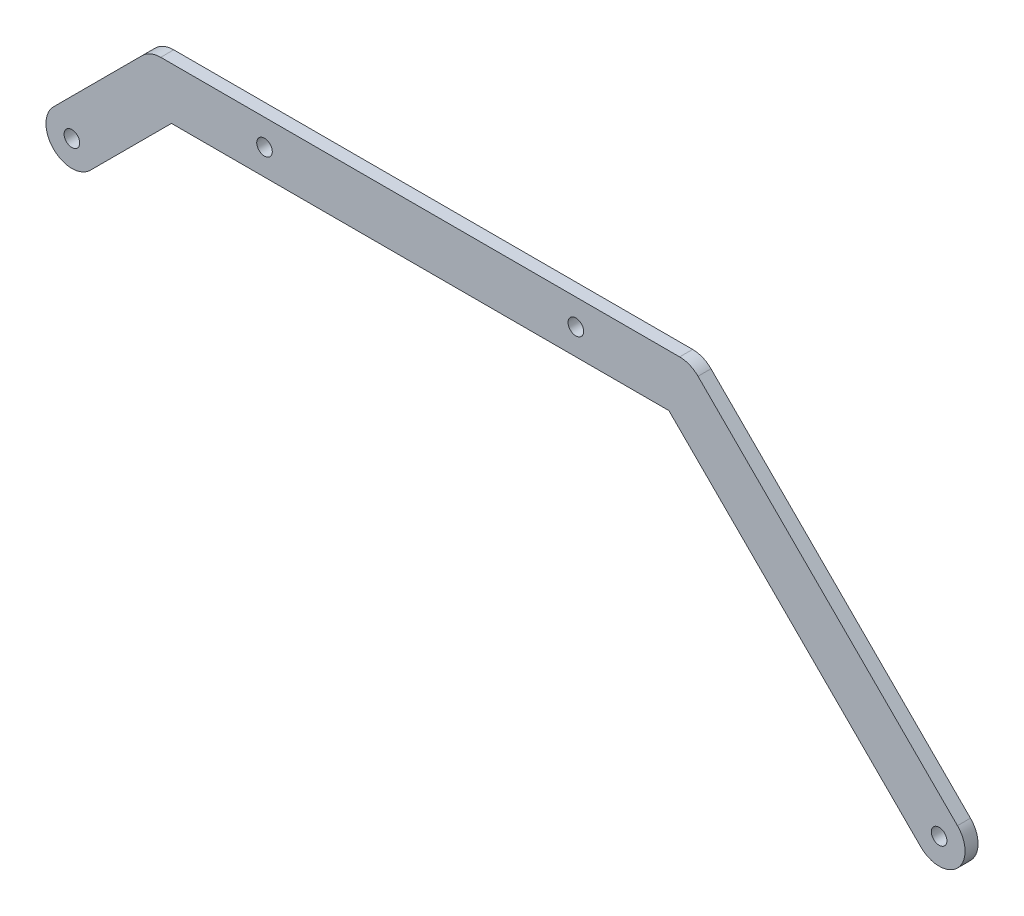
ISO-10303-21;
HEADER;
FILE_DESCRIPTION(('STEP AP214'),'2;1');
FILE_NAME('part.step','',(''),(''),'','','');
FILE_SCHEMA(('AUTOMOTIVE_DESIGN { 1 0 10303 214 1 1 1 1 }'));
ENDSEC;
DATA;
#1=APPLICATION_CONTEXT('core data for automotive mechanical design processes');
#2=APPLICATION_PROTOCOL_DEFINITION('international standard','automotive_design',2000,#1);
#3=PRODUCT_CONTEXT('',#1,'mechanical');
#4=PRODUCT('Part','Part','',(#3));
#5=PRODUCT_RELATED_PRODUCT_CATEGORY('part','',(#4));
#6=PRODUCT_DEFINITION_FORMATION('','',#4);
#7=PRODUCT_DEFINITION_CONTEXT('part definition',#1,'design');
#8=PRODUCT_DEFINITION('design','',#6,#7);
#9=PRODUCT_DEFINITION_SHAPE('','',#8);
#10=(LENGTH_UNIT() NAMED_UNIT(*) SI_UNIT(.MILLI.,.METRE.));
#11=(NAMED_UNIT(*) PLANE_ANGLE_UNIT() SI_UNIT($,.RADIAN.));
#12=(NAMED_UNIT(*) SI_UNIT($,.STERADIAN.) SOLID_ANGLE_UNIT());
#13=UNCERTAINTY_MEASURE_WITH_UNIT(LENGTH_MEASURE(1.E-05),#10,'distance_accuracy_value','');
#14=(GEOMETRIC_REPRESENTATION_CONTEXT(3) GLOBAL_UNCERTAINTY_ASSIGNED_CONTEXT((#13)) GLOBAL_UNIT_ASSIGNED_CONTEXT((#10,
#11,#12)) REPRESENTATION_CONTEXT('',''));
#15=CARTESIAN_POINT('',(0.,0.,0.));
#16=DIRECTION('',(0.,0.,1.));
#17=DIRECTION('',(1.,0.,0.));
#18=AXIS2_PLACEMENT_3D('',#15,#16,#17);
#19=CARTESIAN_POINT('',(0.,-10.0000000000005,5.));
#20=DIRECTION('',(0.,1.,0.));
#21=DIRECTION('',(-1.,0.,0.));
#22=AXIS2_PLACEMENT_3D('',#19,#20,#21);
#23=PLANE('',#22);
#24=DIRECTION('',(1.,0.,0.));
#25=VECTOR('',#24,1.);
#26=CARTESIAN_POINT('',(0.,-10.0000000000005,0.));
#27=LINE('',#26,#25);
#28=CARTESIAN_POINT('',(-195.857864376269,-10.0000000000001,0.));
#29=VERTEX_POINT('',#28);
#30=CARTESIAN_POINT('',(-4.14213562373144,-10.0000000000005,0.));
#31=VERTEX_POINT('',#30);
#32=EDGE_CURVE('E157',#29,#31,#27,.T.);
#33=ORIENTED_EDGE('',*,*,#32,.T.);
#34=DIRECTION('',(0.,0.,-1.));
#35=VECTOR('',#34,1.);
#36=CARTESIAN_POINT('',(-4.14213562373144,-10.0000000000005,5.));
#37=LINE('',#36,#35);
#38=CARTESIAN_POINT('',(-4.14213562373144,-10.0000000000005,5.));
#39=VERTEX_POINT('',#38);
#40=EDGE_CURVE('E11',#39,#31,#37,.T.);
#41=ORIENTED_EDGE('',*,*,#40,.F.);
#42=DIRECTION('',(1.,0.,0.));
#43=VECTOR('',#42,1.);
#44=CARTESIAN_POINT('',(0.,-10.0000000000005,5.));
#45=LINE('',#44,#43);
#46=CARTESIAN_POINT('',(-195.857864376269,-10.0000000000001,5.));
#47=VERTEX_POINT('',#46);
#48=EDGE_CURVE('E193',#47,#39,#45,.T.);
#49=ORIENTED_EDGE('',*,*,#48,.F.);
#50=DIRECTION('',(0.,0.,-1.));
#51=VECTOR('',#50,1.);
#52=CARTESIAN_POINT('',(-195.857864376269,-10.0000000000001,5.));
#53=LINE('',#52,#51);
#54=EDGE_CURVE('E50',#47,#29,#53,.T.);
#55=ORIENTED_EDGE('',*,*,#54,.T.);
#56=EDGE_LOOP('',(#33,#41,#49,#55));
#57=FACE_BOUND('',#56,.T.);
#58=ADVANCED_FACE('F34',(#57),#23,.F.);
#59=CARTESIAN_POINT('',(-7.07106781186593,-7.07106781186603,5.));
#60=DIRECTION('',(0.707106781186543,0.707106781186552,0.));
#61=DIRECTION('',(-0.707106781186552,0.707106781186543,0.));
#62=AXIS2_PLACEMENT_3D('',#59,#60,#61);
#63=PLANE('',#62);
#64=DIRECTION('',(0.707106781186552,-0.707106781186543,0.));
#65=VECTOR('',#64,1.);
#66=CARTESIAN_POINT('',(-7.07106781186593,-7.07106781186603,0.));
#67=LINE('',#66,#65);
#68=CARTESIAN_POINT('',(92.928932188135,-107.071067811866,0.));
#69=VERTEX_POINT('',#68);
#70=EDGE_CURVE('E159',#31,#69,#67,.T.);
#71=ORIENTED_EDGE('',*,*,#70,.T.);
#72=DIRECTION('',(0.,0.,-1.));
#73=VECTOR('',#72,1.);
#74=CARTESIAN_POINT('',(92.928932188135,-107.071067811866,5.));
#75=LINE('',#74,#73);
#76=CARTESIAN_POINT('',(92.928932188135,-107.071067811866,5.));
#77=VERTEX_POINT('',#76);
#78=EDGE_CURVE('E42',#77,#69,#75,.T.);
#79=ORIENTED_EDGE('',*,*,#78,.F.);
#80=DIRECTION('',(0.707106781186552,-0.707106781186543,0.));
#81=VECTOR('',#80,1.);
#82=CARTESIAN_POINT('',(-7.07106781186593,-7.07106781186603,5.));
#83=LINE('',#82,#81);
#84=EDGE_CURVE('E95',#39,#77,#83,.T.);
#85=ORIENTED_EDGE('',*,*,#84,.F.);
#86=ORIENTED_EDGE('',*,*,#40,.T.);
#87=EDGE_LOOP('',(#71,#79,#85,#86));
#88=FACE_BOUND('',#87,.T.);
#89=ADVANCED_FACE('F248',(#88),#63,.F.);
#90=CARTESIAN_POINT('',(100.,-100.,5.));
#91=DIRECTION('',(0.,0.,-1.));
#92=DIRECTION('',(-1.,0.,0.));
#93=AXIS2_PLACEMENT_3D('',#90,#91,#92);
#94=CYLINDRICAL_SURFACE('',#93,10.);
#95=CARTESIAN_POINT('',(100.,-100.,0.));
#96=DIRECTION('',(0.,0.,1.));
#97=DIRECTION('',(1.,0.,0.));
#98=AXIS2_PLACEMENT_3D('',#95,#96,#97);
#99=CIRCLE('',#98,10.);
#100=CARTESIAN_POINT('',(107.071067811866,-92.9289321881345,0.));
#101=VERTEX_POINT('',#100);
#102=EDGE_CURVE('E161',#69,#101,#99,.T.);
#103=ORIENTED_EDGE('',*,*,#102,.T.);
#104=DIRECTION('',(0.,0.,-1.));
#105=VECTOR('',#104,1.);
#106=CARTESIAN_POINT('',(107.071067811866,-92.9289321881345,5.));
#107=LINE('',#106,#105);
#108=CARTESIAN_POINT('',(107.071067811866,-92.9289321881345,5.));
#109=VERTEX_POINT('',#108);
#110=EDGE_CURVE('E203',#109,#101,#107,.T.);
#111=ORIENTED_EDGE('',*,*,#110,.F.);
#112=CARTESIAN_POINT('',(100.,-100.,5.));
#113=DIRECTION('',(0.,0.,1.));
#114=DIRECTION('',(1.,0.,0.));
#115=AXIS2_PLACEMENT_3D('',#112,#113,#114);
#116=CIRCLE('',#115,10.);
#117=EDGE_CURVE('E210',#77,#109,#116,.T.);
#118=ORIENTED_EDGE('',*,*,#117,.F.);
#119=ORIENTED_EDGE('',*,*,#78,.T.);
#120=EDGE_LOOP('',(#103,#111,#118,#119));
#121=FACE_BOUND('',#120,.T.);
#122=ADVANCED_FACE('F208',(#121),#94,.T.);
#123=CARTESIAN_POINT('',(7.07106781186546,7.07106781186548,5.));
#124=DIRECTION('',(0.707106781186546,0.707106781186549,0.));
#125=DIRECTION('',(-0.707106781186549,0.707106781186546,0.));
#126=AXIS2_PLACEMENT_3D('',#123,#124,#125);
#127=PLANE('',#126);
#128=DIRECTION('',(0.707106781186549,-0.707106781186546,0.));
#129=VECTOR('',#128,1.);
#130=CARTESIAN_POINT('',(7.07106781186546,7.07106781186548,0.));
#131=LINE('',#130,#129);
#132=CARTESIAN_POINT('',(7.07106781186546,7.07106781186548,0.));
#133=VERTEX_POINT('',#132);
#134=EDGE_CURVE('E164',#133,#101,#131,.T.);
#135=ORIENTED_EDGE('',*,*,#134,.F.);
#136=DIRECTION('',(0.,0.,-1.));
#137=VECTOR('',#136,1.);
#138=CARTESIAN_POINT('',(7.07106781186546,7.07106781186548,5.));
#139=LINE('',#138,#137);
#140=CARTESIAN_POINT('',(7.07106781186546,7.07106781186548,5.));
#141=VERTEX_POINT('',#140);
#142=EDGE_CURVE('E201',#141,#133,#139,.T.);
#143=ORIENTED_EDGE('',*,*,#142,.F.);
#144=DIRECTION('',(0.707106781186549,-0.707106781186546,0.));
#145=VECTOR('',#144,1.);
#146=CARTESIAN_POINT('',(7.07106781186546,7.07106781186548,5.));
#147=LINE('',#146,#145);
#148=EDGE_CURVE('E221',#141,#109,#147,.T.);
#149=ORIENTED_EDGE('',*,*,#148,.T.);
#150=ORIENTED_EDGE('',*,*,#110,.T.);
#151=EDGE_LOOP('',(#135,#143,#149,#150));
#152=FACE_BOUND('',#151,.T.);
#153=ADVANCED_FACE('F217',(#152),#127,.T.);
#154=CARTESIAN_POINT('',(0.,0.,5.));
#155=DIRECTION('',(0.,0.,-1.));
#156=DIRECTION('',(-1.,0.,0.));
#157=AXIS2_PLACEMENT_3D('',#154,#155,#156);
#158=CYLINDRICAL_SURFACE('',#157,10.);
#159=CARTESIAN_POINT('',(0.,0.,0.));
#160=DIRECTION('',(0.,0.,1.));
#161=DIRECTION('',(1.,0.,0.));
#162=AXIS2_PLACEMENT_3D('',#159,#160,#161);
#163=CIRCLE('',#162,10.);
#164=CARTESIAN_POINT('',(0.,10.,0.));
#165=VERTEX_POINT('',#164);
#166=EDGE_CURVE('E167',#133,#165,#163,.T.);
#167=ORIENTED_EDGE('',*,*,#166,.T.);
#168=DIRECTION('',(0.,0.,-1.));
#169=VECTOR('',#168,1.);
#170=CARTESIAN_POINT('',(0.,10.,5.));
#171=LINE('',#170,#169);
#172=CARTESIAN_POINT('',(0.,10.,5.));
#173=VERTEX_POINT('',#172);
#174=EDGE_CURVE('E199',#173,#165,#171,.T.);
#175=ORIENTED_EDGE('',*,*,#174,.F.);
#176=CARTESIAN_POINT('',(0.,0.,5.));
#177=DIRECTION('',(0.,0.,1.));
#178=DIRECTION('',(1.,0.,0.));
#179=AXIS2_PLACEMENT_3D('',#176,#177,#178);
#180=CIRCLE('',#179,10.);
#181=EDGE_CURVE('E222',#141,#173,#180,.T.);
#182=ORIENTED_EDGE('',*,*,#181,.F.);
#183=ORIENTED_EDGE('',*,*,#142,.T.);
#184=EDGE_LOOP('',(#167,#175,#182,#183));
#185=FACE_BOUND('',#184,.T.);
#186=ADVANCED_FACE('F235',(#185),#158,.T.);
#187=CARTESIAN_POINT('',(0.,10.,5.));
#188=DIRECTION('',(0.,1.,0.));
#189=DIRECTION('',(-1.,0.,0.));
#190=AXIS2_PLACEMENT_3D('',#187,#188,#189);
#191=PLANE('',#190);
#192=DIRECTION('',(1.,0.,0.));
#193=VECTOR('',#192,1.);
#194=CARTESIAN_POINT('',(0.,10.,0.));
#195=LINE('',#194,#193);
#196=CARTESIAN_POINT('',(-200.,10.,0.));
#197=VERTEX_POINT('',#196);
#198=EDGE_CURVE('E170',#197,#165,#195,.T.);
#199=ORIENTED_EDGE('',*,*,#198,.F.);
#200=DIRECTION('',(0.,0.,-1.));
#201=VECTOR('',#200,1.);
#202=CARTESIAN_POINT('',(-200.,10.,5.));
#203=LINE('',#202,#201);
#204=CARTESIAN_POINT('',(-200.,10.,5.));
#205=VERTEX_POINT('',#204);
#206=EDGE_CURVE('E197',#205,#197,#203,.T.);
#207=ORIENTED_EDGE('',*,*,#206,.F.);
#208=DIRECTION('',(1.,0.,0.));
#209=VECTOR('',#208,1.);
#210=CARTESIAN_POINT('',(0.,10.,5.));
#211=LINE('',#210,#209);
#212=EDGE_CURVE('E224',#205,#173,#211,.T.);
#213=ORIENTED_EDGE('',*,*,#212,.T.);
#214=ORIENTED_EDGE('',*,*,#174,.T.);
#215=EDGE_LOOP('',(#199,#207,#213,#214));
#216=FACE_BOUND('',#215,.T.);
#217=ADVANCED_FACE('F232',(#216),#191,.T.);
#218=CARTESIAN_POINT('',(-200.,0.,5.));
#219=DIRECTION('',(0.,0.,-1.));
#220=DIRECTION('',(-1.,0.,0.));
#221=AXIS2_PLACEMENT_3D('',#218,#219,#220);
#222=CYLINDRICAL_SURFACE('',#221,9.99999999999998);
#223=CARTESIAN_POINT('',(-200.,0.,0.));
#224=DIRECTION('',(0.,0.,1.));
#225=DIRECTION('',(1.,0.,0.));
#226=AXIS2_PLACEMENT_3D('',#223,#224,#225);
#227=CIRCLE('',#226,9.99999999999998);
#228=CARTESIAN_POINT('',(-207.071067811865,7.07106781186542,0.));
#229=VERTEX_POINT('',#228);
#230=EDGE_CURVE('E173',#197,#229,#227,.T.);
#231=ORIENTED_EDGE('',*,*,#230,.T.);
#232=DIRECTION('',(0.,0.,-1.));
#233=VECTOR('',#232,1.);
#234=CARTESIAN_POINT('',(-207.071067811865,7.07106781186542,5.));
#235=LINE('',#234,#233);
#236=CARTESIAN_POINT('',(-207.071067811865,7.07106781186542,5.));
#237=VERTEX_POINT('',#236);
#238=EDGE_CURVE('E137',#237,#229,#235,.T.);
#239=ORIENTED_EDGE('',*,*,#238,.F.);
#240=CARTESIAN_POINT('',(-200.,0.,5.));
#241=DIRECTION('',(0.,0.,1.));
#242=DIRECTION('',(1.,0.,0.));
#243=AXIS2_PLACEMENT_3D('',#240,#241,#242);
#244=CIRCLE('',#243,9.99999999999998);
#245=EDGE_CURVE('E125',#205,#237,#244,.T.);
#246=ORIENTED_EDGE('',*,*,#245,.F.);
#247=ORIENTED_EDGE('',*,*,#206,.T.);
#248=EDGE_LOOP('',(#231,#239,#246,#247));
#249=FACE_BOUND('',#248,.T.);
#250=ADVANCED_FACE('F238',(#249),#222,.T.);
#251=CARTESIAN_POINT('',(-107.071067811865,107.071067811865,5.));
#252=DIRECTION('',(0.707106781186546,-0.707106781186549,0.));
#253=DIRECTION('',(0.707106781186549,0.707106781186546,0.));
#254=AXIS2_PLACEMENT_3D('',#251,#252,#253);
#255=PLANE('',#254);
#256=DIRECTION('',(-0.707106781186549,-0.707106781186546,0.));
#257=VECTOR('',#256,1.);
#258=CARTESIAN_POINT('',(-107.071067811865,107.071067811865,0.));
#259=LINE('',#258,#257);
#260=CARTESIAN_POINT('',(-241.304014214317,-27.1618785905859,0.));
#261=VERTEX_POINT('',#260);
#262=EDGE_CURVE('E134',#229,#261,#259,.T.);
#263=ORIENTED_EDGE('',*,*,#262,.T.);
#264=DIRECTION('',(0.,0.,-1.));
#265=VECTOR('',#264,1.);
#266=CARTESIAN_POINT('',(-241.304014214317,-27.1618785905859,5.));
#267=LINE('',#266,#265);
#268=CARTESIAN_POINT('',(-241.304014214317,-27.1618785905859,5.));
#269=VERTEX_POINT('',#268);
#270=EDGE_CURVE('E131',#269,#261,#267,.T.);
#271=ORIENTED_EDGE('',*,*,#270,.F.);
#272=DIRECTION('',(-0.707106781186549,-0.707106781186546,0.));
#273=VECTOR('',#272,1.);
#274=CARTESIAN_POINT('',(-107.071067811865,107.071067811865,5.));
#275=LINE('',#274,#273);
#276=EDGE_CURVE('E116',#237,#269,#275,.T.);
#277=ORIENTED_EDGE('',*,*,#276,.F.);
#278=ORIENTED_EDGE('',*,*,#238,.T.);
#279=EDGE_LOOP('',(#263,#271,#277,#278));
#280=FACE_BOUND('',#279,.T.);
#281=ADVANCED_FACE('F132',(#280),#255,.F.);
#282=CARTESIAN_POINT('',(-234.232946402452,-34.2329464024515,5.));
#283=DIRECTION('',(0.,0.,-1.));
#284=DIRECTION('',(-1.,0.,0.));
#285=AXIS2_PLACEMENT_3D('',#282,#283,#284);
#286=CYLINDRICAL_SURFACE('',#285,9.99999999999996);
#287=CARTESIAN_POINT('',(-234.232946402452,-34.2329464024515,0.));
#288=DIRECTION('',(0.,0.,1.));
#289=DIRECTION('',(1.,0.,0.));
#290=AXIS2_PLACEMENT_3D('',#287,#288,#289);
#291=CIRCLE('',#290,9.99999999999996);
#292=CARTESIAN_POINT('',(-227.161878590586,-41.3040142143169,0.));
#293=VERTEX_POINT('',#292);
#294=EDGE_CURVE('E176',#261,#293,#291,.T.);
#295=ORIENTED_EDGE('',*,*,#294,.T.);
#296=DIRECTION('',(0.,0.,-1.));
#297=VECTOR('',#296,1.);
#298=CARTESIAN_POINT('',(-227.161878590586,-41.3040142143169,5.));
#299=LINE('',#298,#297);
#300=CARTESIAN_POINT('',(-227.161878590586,-41.3040142143169,5.));
#301=VERTEX_POINT('',#300);
#302=EDGE_CURVE('E83',#301,#293,#299,.T.);
#303=ORIENTED_EDGE('',*,*,#302,.F.);
#304=CARTESIAN_POINT('',(-234.232946402452,-34.2329464024515,5.));
#305=DIRECTION('',(0.,0.,1.));
#306=DIRECTION('',(1.,0.,0.));
#307=AXIS2_PLACEMENT_3D('',#304,#305,#306);
#308=CIRCLE('',#307,9.99999999999996);
#309=EDGE_CURVE('E122',#269,#301,#308,.T.);
#310=ORIENTED_EDGE('',*,*,#309,.F.);
#311=ORIENTED_EDGE('',*,*,#270,.T.);
#312=EDGE_LOOP('',(#295,#303,#310,#311));
#313=FACE_BOUND('',#312,.T.);
#314=ADVANCED_FACE('F139',(#313),#286,.T.);
#315=CARTESIAN_POINT('',(100.,-100.,5.));
#316=DIRECTION('',(0.,0.,-1.));
#317=DIRECTION('',(-1.,0.,0.));
#318=AXIS2_PLACEMENT_3D('',#315,#316,#317);
#319=CYLINDRICAL_SURFACE('',#318,3.00000000000001);
#320=CARTESIAN_POINT('',(100.,-100.,5.));
#321=DIRECTION('',(0.,0.,1.));
#322=DIRECTION('',(1.,0.,0.));
#323=AXIS2_PLACEMENT_3D('',#320,#321,#322);
#324=CIRCLE('',#323,3.00000000000001);
#325=CARTESIAN_POINT('',(103.,-100.,5.));
#326=VERTEX_POINT('',#325);
#327=EDGE_CURVE('E151',#326,#326,#324,.T.);
#328=ORIENTED_EDGE('',*,*,#327,.T.);
#329=EDGE_LOOP('',(#328));
#330=FACE_BOUND('',#329,.T.);
#331=CARTESIAN_POINT('',(100.,-100.,0.));
#332=DIRECTION('',(0.,0.,1.));
#333=DIRECTION('',(1.,0.,0.));
#334=AXIS2_PLACEMENT_3D('',#331,#332,#333);
#335=CIRCLE('',#334,3.00000000000001);
#336=CARTESIAN_POINT('',(103.,-100.,0.));
#337=VERTEX_POINT('',#336);
#338=EDGE_CURVE('E187',#337,#337,#335,.T.);
#339=ORIENTED_EDGE('',*,*,#338,.F.);
#340=EDGE_LOOP('',(#339));
#341=FACE_BOUND('',#340,.T.);
#342=ADVANCED_FACE('F270',(#330,#341),#319,.F.);
#343=CARTESIAN_POINT('',(-160.,0.,5.));
#344=DIRECTION('',(0.,0.,-1.));
#345=DIRECTION('',(-1.,0.,0.));
#346=AXIS2_PLACEMENT_3D('',#343,#344,#345);
#347=CYLINDRICAL_SURFACE('',#346,2.99999999999999);
#348=CARTESIAN_POINT('',(-160.,0.,5.));
#349=DIRECTION('',(0.,0.,1.));
#350=DIRECTION('',(1.,0.,0.));
#351=AXIS2_PLACEMENT_3D('',#348,#349,#350);
#352=CIRCLE('',#351,2.99999999999999);
#353=CARTESIAN_POINT('',(-157.,0.,5.));
#354=VERTEX_POINT('',#353);
#355=EDGE_CURVE('E148',#354,#354,#352,.T.);
#356=ORIENTED_EDGE('',*,*,#355,.T.);
#357=EDGE_LOOP('',(#356));
#358=FACE_BOUND('',#357,.T.);
#359=CARTESIAN_POINT('',(-160.,0.,0.));
#360=DIRECTION('',(0.,0.,1.));
#361=DIRECTION('',(1.,0.,0.));
#362=AXIS2_PLACEMENT_3D('',#359,#360,#361);
#363=CIRCLE('',#362,2.99999999999999);
#364=CARTESIAN_POINT('',(-157.,0.,0.));
#365=VERTEX_POINT('',#364);
#366=EDGE_CURVE('E184',#365,#365,#363,.T.);
#367=ORIENTED_EDGE('',*,*,#366,.F.);
#368=EDGE_LOOP('',(#367));
#369=FACE_BOUND('',#368,.T.);
#370=ADVANCED_FACE('F264',(#358,#369),#347,.F.);
#371=CARTESIAN_POINT('',(-40.,0.,5.));
#372=DIRECTION('',(0.,0.,-1.));
#373=DIRECTION('',(-1.,0.,0.));
#374=AXIS2_PLACEMENT_3D('',#371,#372,#373);
#375=CYLINDRICAL_SURFACE('',#374,3.);
#376=CARTESIAN_POINT('',(-40.,0.,5.));
#377=DIRECTION('',(0.,0.,1.));
#378=DIRECTION('',(1.,0.,0.));
#379=AXIS2_PLACEMENT_3D('',#376,#377,#378);
#380=CIRCLE('',#379,3.);
#381=CARTESIAN_POINT('',(-37.,0.,5.));
#382=VERTEX_POINT('',#381);
#383=EDGE_CURVE('E142',#382,#382,#380,.T.);
#384=ORIENTED_EDGE('',*,*,#383,.T.);
#385=EDGE_LOOP('',(#384));
#386=FACE_BOUND('',#385,.T.);
#387=CARTESIAN_POINT('',(-40.,0.,0.));
#388=DIRECTION('',(0.,0.,1.));
#389=DIRECTION('',(1.,0.,0.));
#390=AXIS2_PLACEMENT_3D('',#387,#388,#389);
#391=CIRCLE('',#390,3.);
#392=CARTESIAN_POINT('',(-37.,0.,0.));
#393=VERTEX_POINT('',#392);
#394=EDGE_CURVE('E181',#393,#393,#391,.T.);
#395=ORIENTED_EDGE('',*,*,#394,.F.);
#396=EDGE_LOOP('',(#395));
#397=FACE_BOUND('',#396,.T.);
#398=ADVANCED_FACE('F256',(#386,#397),#375,.F.);
#399=CARTESIAN_POINT('',(-92.9289321881335,92.9289321881344,5.));
#400=DIRECTION('',(0.707106781186544,-0.707106781186551,0.));
#401=DIRECTION('',(0.707106781186551,0.707106781186544,0.));
#402=AXIS2_PLACEMENT_3D('',#399,#400,#401);
#403=PLANE('',#402);
#404=DIRECTION('',(-0.707106781186551,-0.707106781186544,0.));
#405=VECTOR('',#404,1.);
#406=CARTESIAN_POINT('',(-92.9289321881335,92.9289321881344,0.));
#407=LINE('',#406,#405);
#408=EDGE_CURVE('E178',#29,#293,#407,.T.);
#409=ORIENTED_EDGE('',*,*,#408,.F.);
#410=ORIENTED_EDGE('',*,*,#54,.F.);
#411=DIRECTION('',(-0.707106781186551,-0.707106781186544,0.));
#412=VECTOR('',#411,1.);
#413=CARTESIAN_POINT('',(-92.9289321881335,92.9289321881344,5.));
#414=LINE('',#413,#412);
#415=EDGE_CURVE('E140',#47,#301,#414,.T.);
#416=ORIENTED_EDGE('',*,*,#415,.T.);
#417=ORIENTED_EDGE('',*,*,#302,.T.);
#418=EDGE_LOOP('',(#409,#410,#416,#417));
#419=FACE_BOUND('',#418,.T.);
#420=ADVANCED_FACE('F253',(#419),#403,.T.);
#421=CARTESIAN_POINT('',(-234.232946402452,-34.2329464024515,5.));
#422=DIRECTION('',(0.,0.,-1.));
#423=DIRECTION('',(-1.,0.,0.));
#424=AXIS2_PLACEMENT_3D('',#421,#422,#423);
#425=CYLINDRICAL_SURFACE('',#424,2.99999999999999);
#426=CARTESIAN_POINT('',(-234.232946402452,-34.2329464024515,5.));
#427=DIRECTION('',(0.,0.,1.));
#428=DIRECTION('',(1.,0.,0.));
#429=AXIS2_PLACEMENT_3D('',#426,#427,#428);
#430=CIRCLE('',#429,2.99999999999999);
#431=CARTESIAN_POINT('',(-231.232946402452,-34.2329464024515,5.));
#432=VERTEX_POINT('',#431);
#433=EDGE_CURVE('E154',#432,#432,#430,.T.);
#434=ORIENTED_EDGE('',*,*,#433,.T.);
#435=EDGE_LOOP('',(#434));
#436=FACE_BOUND('',#435,.T.);
#437=CARTESIAN_POINT('',(-234.232946402452,-34.2329464024515,0.));
#438=DIRECTION('',(0.,0.,1.));
#439=DIRECTION('',(1.,0.,0.));
#440=AXIS2_PLACEMENT_3D('',#437,#438,#439);
#441=CIRCLE('',#440,2.99999999999999);
#442=CARTESIAN_POINT('',(-231.232946402452,-34.2329464024515,0.));
#443=VERTEX_POINT('',#442);
#444=EDGE_CURVE('E190',#443,#443,#441,.T.);
#445=ORIENTED_EDGE('',*,*,#444,.F.);
#446=EDGE_LOOP('',(#445));
#447=FACE_BOUND('',#446,.T.);
#448=ADVANCED_FACE('F255',(#436,#447),#425,.F.);
#449=CARTESIAN_POINT('',(0.,0.,5.));
#450=DIRECTION('',(0.,0.,1.));
#451=DIRECTION('',(1.,0.,0.));
#452=AXIS2_PLACEMENT_3D('',#449,#450,#451);
#453=PLANE('',#452);
#454=ORIENTED_EDGE('',*,*,#48,.T.);
#455=ORIENTED_EDGE('',*,*,#84,.T.);
#456=ORIENTED_EDGE('',*,*,#117,.T.);
#457=ORIENTED_EDGE('',*,*,#148,.F.);
#458=ORIENTED_EDGE('',*,*,#181,.T.);
#459=ORIENTED_EDGE('',*,*,#212,.F.);
#460=ORIENTED_EDGE('',*,*,#245,.T.);
#461=ORIENTED_EDGE('',*,*,#276,.T.);
#462=ORIENTED_EDGE('',*,*,#309,.T.);
#463=ORIENTED_EDGE('',*,*,#415,.F.);
#464=EDGE_LOOP('',(#454,#455,#456,#457,#458,#459,#460,#461,#462,#463));
#465=FACE_BOUND('',#464,.T.);
#466=ORIENTED_EDGE('',*,*,#383,.F.);
#467=EDGE_LOOP('',(#466));
#468=FACE_BOUND('',#467,.T.);
#469=ORIENTED_EDGE('',*,*,#355,.F.);
#470=EDGE_LOOP('',(#469));
#471=FACE_BOUND('',#470,.T.);
#472=ORIENTED_EDGE('',*,*,#327,.F.);
#473=EDGE_LOOP('',(#472));
#474=FACE_BOUND('',#473,.T.);
#475=ORIENTED_EDGE('',*,*,#433,.F.);
#476=EDGE_LOOP('',(#475));
#477=FACE_BOUND('',#476,.T.);
#478=ADVANCED_FACE('F118',(#465,#468,#471,#474,#477),#453,.T.);
#479=CARTESIAN_POINT('',(0.,0.,0.));
#480=DIRECTION('',(0.,0.,1.));
#481=DIRECTION('',(1.,0.,0.));
#482=AXIS2_PLACEMENT_3D('',#479,#480,#481);
#483=PLANE('',#482);
#484=ORIENTED_EDGE('',*,*,#32,.F.);
#485=ORIENTED_EDGE('',*,*,#408,.T.);
#486=ORIENTED_EDGE('',*,*,#294,.F.);
#487=ORIENTED_EDGE('',*,*,#262,.F.);
#488=ORIENTED_EDGE('',*,*,#230,.F.);
#489=ORIENTED_EDGE('',*,*,#198,.T.);
#490=ORIENTED_EDGE('',*,*,#166,.F.);
#491=ORIENTED_EDGE('',*,*,#134,.T.);
#492=ORIENTED_EDGE('',*,*,#102,.F.);
#493=ORIENTED_EDGE('',*,*,#70,.F.);
#494=EDGE_LOOP('',(#484,#485,#486,#487,#488,#489,#490,#491,#492,#493));
#495=FACE_BOUND('',#494,.T.);
#496=ORIENTED_EDGE('',*,*,#394,.T.);
#497=EDGE_LOOP('',(#496));
#498=FACE_BOUND('',#497,.T.);
#499=ORIENTED_EDGE('',*,*,#366,.T.);
#500=EDGE_LOOP('',(#499));
#501=FACE_BOUND('',#500,.T.);
#502=ORIENTED_EDGE('',*,*,#338,.T.);
#503=EDGE_LOOP('',(#502));
#504=FACE_BOUND('',#503,.T.);
#505=ORIENTED_EDGE('',*,*,#444,.T.);
#506=EDGE_LOOP('',(#505));
#507=FACE_BOUND('',#506,.T.);
#508=ADVANCED_FACE('F212',(#495,#498,#501,#504,#507),#483,.F.);
#509=CLOSED_SHELL('',(#58,#89,#122,#153,#186,#217,#250,#281,#314,#342,#370,#398,#420,#448,#478,#508));
#510=MANIFOLD_SOLID_BREP('B2',#509);
#511=ADVANCED_BREP_SHAPE_REPRESENTATION('',(#18,#510),#14);
#512=SHAPE_DEFINITION_REPRESENTATION(#9,#511);
ENDSEC;
END-ISO-10303-21;
